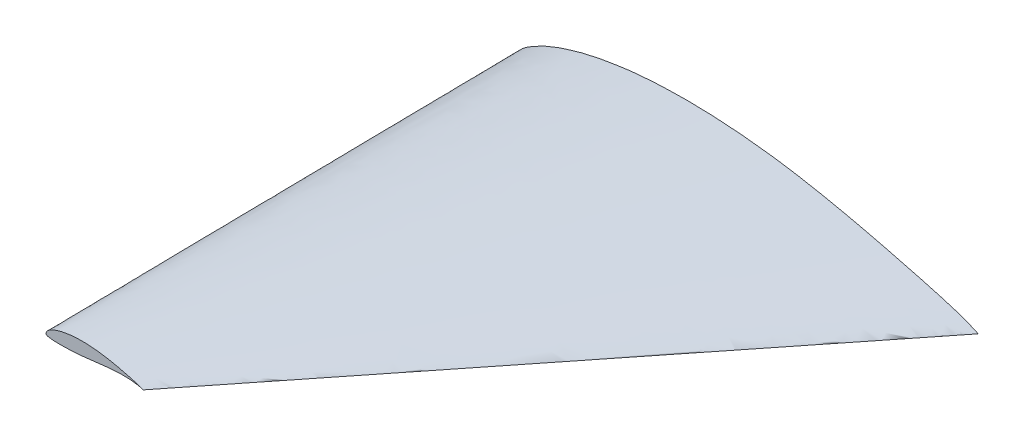
ISO-10303-21;
HEADER;
FILE_DESCRIPTION(('STEP AP214'),'2;1');
FILE_NAME('part.step','',(''),(''),'','','');
FILE_SCHEMA(('AUTOMOTIVE_DESIGN { 1 0 10303 214 1 1 1 1 }'));
ENDSEC;
DATA;
#1=APPLICATION_CONTEXT('core data for automotive mechanical design processes');
#2=APPLICATION_PROTOCOL_DEFINITION('international standard','automotive_design',2000,#1);
#3=PRODUCT_CONTEXT('',#1,'mechanical');
#4=PRODUCT('Part','Part','',(#3));
#5=PRODUCT_RELATED_PRODUCT_CATEGORY('part','',(#4));
#6=PRODUCT_DEFINITION_FORMATION('','',#4);
#7=PRODUCT_DEFINITION_CONTEXT('part definition',#1,'design');
#8=PRODUCT_DEFINITION('design','',#6,#7);
#9=PRODUCT_DEFINITION_SHAPE('','',#8);
#10=(LENGTH_UNIT() NAMED_UNIT(*) SI_UNIT(.MILLI.,.METRE.));
#11=(NAMED_UNIT(*) PLANE_ANGLE_UNIT() SI_UNIT($,.RADIAN.));
#12=(NAMED_UNIT(*) SI_UNIT($,.STERADIAN.) SOLID_ANGLE_UNIT());
#13=UNCERTAINTY_MEASURE_WITH_UNIT(LENGTH_MEASURE(1.E-05),#10,'distance_accuracy_value','');
#14=(GEOMETRIC_REPRESENTATION_CONTEXT(3) GLOBAL_UNCERTAINTY_ASSIGNED_CONTEXT((#13)) GLOBAL_UNIT_ASSIGNED_CONTEXT((#10,
#11,#12)) REPRESENTATION_CONTEXT('',''));
#15=CARTESIAN_POINT('',(0.,0.,0.));
#16=DIRECTION('',(0.,0.,1.));
#17=DIRECTION('',(1.,0.,0.));
#18=AXIS2_PLACEMENT_3D('',#15,#16,#17);
#19=CARTESIAN_POINT('',(3.63566016430738,12.8731300769274,0.));
#20=DIRECTION('',(0.,0.,-1.));
#21=DIRECTION('',(-1.,0.,0.));
#22=AXIS2_PLACEMENT_3D('',#19,#20,#21);
#23=PLANE('',#22);
#24=CARTESIAN_POINT('',(609.6,0.,0.));
#25=CARTESIAN_POINT('',(609.640250220161,0.0280382021375049,0.));
#26=CARTESIAN_POINT('',(608.273600949924,0.991597906494797,0.));
#27=CARTESIAN_POINT('',(606.750645735669,1.57760728388307,0.));
#28=CARTESIAN_POINT('',(603.273917166233,3.33402278008084,0.));
#29=CARTESIAN_POINT('',(598.853535085318,5.14379101560847,0.));
#30=CARTESIAN_POINT('',(593.037906504377,7.43654288929596,0.));
#31=CARTESIAN_POINT('',(586.036935584042,9.92047696154409,0.));
#32=CARTESIAN_POINT('',(577.80107358829,12.5986969431511,0.));
#33=CARTESIAN_POINT('',(568.409770871112,15.4715484257038,0.));
#34=CARTESIAN_POINT('',(557.881673990866,18.5085031455133,0.));
#35=CARTESIAN_POINT('',(546.287361494775,21.7798148146497,0.));
#36=CARTESIAN_POINT('',(533.635643822143,25.159398656286,0.));
#37=CARTESIAN_POINT('',(520.039582360879,28.8341493252529,0.));
#38=CARTESIAN_POINT('',(505.48232625381,32.5117139187355,0.));
#39=CARTESIAN_POINT('',(490.111119878469,36.4546792736563,0.));
#40=CARTESIAN_POINT('',(473.893166546495,40.2989331639401,0.));
#41=CARTESIAN_POINT('',(457.016136687147,44.4518304478845,0.));
#42=CARTESIAN_POINT('',(439.415459466033,48.3382333608458,0.));
#43=CARTESIAN_POINT('',(421.324380603662,52.5025118185633,0.));
#44=CARTESIAN_POINT('',(402.64165559914,56.1138719195973,0.));
#45=CARTESIAN_POINT('',(383.628725491852,59.9092582810321,0.));
#46=CARTESIAN_POINT('',(364.191152104201,62.9812414735311,0.));
#47=CARTESIAN_POINT('',(344.575118146023,66.1328189803733,0.));
#48=CARTESIAN_POINT('',(324.713786740934,68.3905465007161,0.));
#49=CARTESIAN_POINT('',(304.83428929943,70.7402948303201,0.));
#50=CARTESIAN_POINT('',(284.899979459847,72.112418245281,0.));
#51=CARTESIAN_POINT('',(265.09146364537,73.5900982867446,0.));
#52=CARTESIAN_POINT('',(245.422303484353,73.9498727804135,0.));
#53=CARTESIAN_POINT('',(226.022430014535,74.514069534288,0.));
#54=CARTESIAN_POINT('',(206.964729509532,73.8951557234952,0.));
#55=CARTESIAN_POINT('',(188.297777099902,73.5306858011844,0.));
#56=CARTESIAN_POINT('',(170.181116665737,71.8512527908715,0.));
#57=CARTESIAN_POINT('',(152.553772661755,70.5049054365717,0.));
#58=CARTESIAN_POINT('',(135.70395253647,67.7632680848869,0.));
#59=CARTESIAN_POINT('',(119.413950571098,65.5428836044923,0.));
#60=CARTESIAN_POINT('',(104.12397862409,61.9451449783644,0.));
#61=CARTESIAN_POINT('',(89.4335140290648,58.9828846616747,0.));
#62=CARTESIAN_POINT('',(75.9752067001072,54.6307865263074,0.));
#63=CARTESIAN_POINT('',(63.1215465717263,51.0399241973245,0.));
#64=CARTESIAN_POINT('',(51.7509151870812,46.0911000893142,0.));
#65=CARTESIAN_POINT('',(40.9203849347088,42.0631121435961,0.));
#66=CARTESIAN_POINT('',(31.8194259014922,36.7526777920157,0.));
#67=CARTESIAN_POINT('',(23.4327029045197,32.2641253838777,0.));
#68=CARTESIAN_POINT('',(16.2023977192562,27.6288591051838,0.));
#69=CARTESIAN_POINT('',(10.470797080345,22.3665949409993,0.));
#70=CARTESIAN_POINT('',(5.65948100997394,16.9298189199479,0.));
#71=CARTESIAN_POINT('',(2.65867308050129,11.0814468073618,0.));
#72=CARTESIAN_POINT('',(0.617865741920156,5.6065892205634,0.));
#73=CARTESIAN_POINT('',(-0.655929974111018,1.22218143363864,0.));
#74=CARTESIAN_POINT('',(0.77223615525635,-1.86037112445842,0.));
#75=CARTESIAN_POINT('',(2.97256895950321,-3.71820165809267,0.));
#76=CARTESIAN_POINT('',(5.83106954973854,-6.53548642981555,0.));
#77=CARTESIAN_POINT('',(10.8519938188363,-7.64180986963954,0.));
#78=CARTESIAN_POINT('',(16.4350524590104,-9.75767155241432,0.));
#79=CARTESIAN_POINT('',(23.6352250413085,-10.2554119591865,0.));
#80=CARTESIAN_POINT('',(31.7722077396816,-11.7719824313956,0.));
#81=CARTESIAN_POINT('',(41.2274276025361,-12.0422650376711,0.));
#82=CARTESIAN_POINT('',(51.7106543069825,-13.1390846087685,0.));
#83=CARTESIAN_POINT('',(63.3369523501553,-13.1929742213514,0.));
#84=CARTESIAN_POINT('',(75.9596642600287,-13.9195624984348,0.));
#85=CARTESIAN_POINT('',(89.5837164163294,-13.7084871910095,0.));
#86=CARTESIAN_POINT('',(104.121785794967,-14.0254315960758,0.));
#87=CARTESIAN_POINT('',(119.512839209373,-13.4556726948701,0.));
#88=CARTESIAN_POINT('',(135.71160985068,-13.2937387951918,0.));
#89=CARTESIAN_POINT('',(152.615912422796,-12.3377356179962,0.));
#90=CARTESIAN_POINT('',(170.198158768286,-11.6563148849318,0.));
#91=CARTESIAN_POINT('',(188.325886746462,-10.2462169966716,0.));
#92=CARTESIAN_POINT('',(206.983555568434,-8.98768281534167,0.));
#93=CARTESIAN_POINT('',(226.026826279837,-7.09343021965525,0.));
#94=CARTESIAN_POINT('',(245.435325997731,-5.21917612280218,0.));
#95=CARTESIAN_POINT('',(265.0767900219,-2.95754402091661,0.));
#96=CARTESIAN_POINT('',(284.905542794965,-0.663932666110339,0.));
#97=CARTESIAN_POINT('',(304.798464384908,1.88224392177554,0.));
#98=CARTESIAN_POINT('',(324.702196825654,4.36409938173803,0.));
#99=CARTESIAN_POINT('',(344.515603781599,6.81494828850699,0.));
#100=CARTESIAN_POINT('',(364.174266921564,8.98396056935296,0.));
#101=CARTESIAN_POINT('',(383.56045221599,11.1080408242607,0.));
#102=CARTESIAN_POINT('',(402.628011225793,12.789417349215,0.));
#103=CARTESIAN_POINT('',(421.260726998088,14.357438305201,0.));
#104=CARTESIAN_POINT('',(439.409781859954,15.4397859373893,0.));
#105=CARTESIAN_POINT('',(456.975503320671,16.3238460388803,0.));
#106=CARTESIAN_POINT('',(473.89420043377,16.7736670592904,0.));
#107=CARTESIAN_POINT('',(490.086340662839,16.9422671889964,0.));
#108=CARTESIAN_POINT('',(505.485612504189,16.7062051078885,0.));
#109=CARTESIAN_POINT('',(520.027650906029,16.1203246618677,0.));
#110=CARTESIAN_POINT('',(533.64708539769,15.1913621731538,0.));
#111=CARTESIAN_POINT('',(546.286886358491,14.017491788534,0.));
#112=CARTESIAN_POINT('',(557.889038006661,12.6028393785622,0.));
#113=CARTESIAN_POINT('',(568.412716917884,11.0466662696429,0.));
#114=CARTESIAN_POINT('',(577.807329036876,9.3581914256114,0.));
#115=CARTESIAN_POINT('',(586.034743447636,7.56237404335013,0.));
#116=CARTESIAN_POINT('',(593.043890905907,5.78303976681588,0.));
#117=CARTESIAN_POINT('',(598.85291485641,3.98242152843298,0.));
#118=CARTESIAN_POINT('',(603.260971943385,2.48665547089167,0.));
#119=CARTESIAN_POINT('',(606.741706407466,1.11972900764847,0.));
#120=CARTESIAN_POINT('',(608.239032163801,0.555969058067613,0.));
#121=CARTESIAN_POINT('',(609.565892996758,-0.0237588526817532,0.));
#122=CARTESIAN_POINT('',(609.6,0.,0.));
#123=B_SPLINE_CURVE_WITH_KNOTS('',3,(#24,#25,#26,#27,#28,#29,#30,#31,#32,#33,#34,#35,#36,#37,
#38,#39,#40,#41,#42,#43,#44,#45,#46,#47,#48,#49,#50,#51,#52,#53,#54,#55,#56,#57,#58,#59,#60,#61,
#62,#63,#64,#65,#66,#67,#68,#69,#70,#71,#72,#73,#74,#75,#76,#77,#78,#79,#80,#81,#82,#83,#84,#85,
#86,#87,#88,#89,#90,#91,#92,#93,#94,#95,#96,#97,#98,#99,#100,#101,#102,#103,#104,#105,#106,#107,
#108,#109,#110,#111,#112,#113,#114,#115,#116,#117,#118,#119,#120,#121,#122),.UNSPECIFIED.,.T.,
.F.,(4,1,1,1,1,1,1,1,1,1,1,1,1,1,1,1,1,1,1,1,1,1,1,1,1,1,1,1,1,1,1,1,1,1,1,1,1,1,1,1,1,1,1,1,1,
1,1,1,1,1,1,1,1,1,1,1,1,1,1,1,1,1,1,1,1,1,1,1,1,1,1,1,1,1,1,1,1,1,1,1,1,1,1,1,1,1,1,1,1,1,1,1,1,
1,1,1,4),(0.,0.000652375800474001,0.00240344824305293,0.00525656825777616,0.00916576414525399,
0.0140967507887129,0.0200220121070894,0.0268963436763612,0.0347063828713069,0.0434144575923079,
0.0529900197240517,0.0633968094728075,0.0746012542197577,0.0865310302989372,0.099154299734113,
0.112392946202992,0.126224491561968,0.140544888717164,0.155318673337255,0.170431652347923,
0.185859272314617,0.201486855100767,0.21729337680491,0.233167489320596,0.249086100090761,
0.264958726174628,0.280747986632832,0.296380919150158,0.311801213814499,0.326956198280747,
0.34178274714053,0.356247564285208,0.370274835051458,0.383861908178782,0.396887692238994,
0.409401211668324,0.421252505987224,0.432540778472774,0.44306525269204,0.452987148289923,
0.462044499089512,0.470525623352609,0.478015713742355,0.484719935647003,0.490901449374763,
0.496493482376747,0.501934630302492,0.506331603851298,0.510717666514293,0.511954044649899,
0.514195842006017,0.517506907461632,0.521314719070869,0.526107089755545,0.531740962786565,
0.538337761174815,0.545822104103918,0.554208083816506,0.563431264261174,0.573484426850772,
0.584310043394845,0.595866543172384,0.608108296907278,0.620979221659939,0.634441733895477,
0.648424207084819,0.662880137047378,0.677739163464503,0.692957281121996,0.708452452705004,
0.724176515371476,0.740041983978664,0.755990469053507,0.771938352799948,0.787811293886201,
0.803535896442132,0.819040498411977,0.834255057735326,0.849121194519524,0.863570137224621,
0.877552378440428,0.891006015922545,0.903874254768139,0.916114355519662,0.927680383940068,
0.938530909249465,0.948621564264013,0.957908586509766,0.96636362872513,0.97395265018994,
0.980639894713798,0.986402982837544,0.991206560358905,0.995011197109476,0.997773025834374,
0.999447193494769,1.),.UNSPECIFIED.);
#124=CARTESIAN_POINT('',(609.6,0.,0.));
#125=VERTEX_POINT('',#124);
#126=EDGE_CURVE('E11',#125,#125,#123,.T.);
#127=ORIENTED_EDGE('',*,*,#126,.F.);
#128=EDGE_LOOP('',(#127));
#129=FACE_BOUND('',#128,.T.);
#130=ADVANCED_FACE('F53',(#129),#23,.T.);
#131=CARTESIAN_POINT('',(0.757429200897371,2.68190209935988,609.6));
#132=DIRECTION('',(0.,0.,-1.));
#133=DIRECTION('',(-1.,0.,0.));
#134=AXIS2_PLACEMENT_3D('',#131,#132,#133);
#135=PLANE('',#134);
#136=CARTESIAN_POINT('',(127.,0.,609.6));
#137=CARTESIAN_POINT('',(127.008385462533,0.00584129211198019,609.6));
#138=CARTESIAN_POINT('',(126.723666864568,0.206582897186416,609.6));
#139=CARTESIAN_POINT('',(126.406384528264,0.328668184142306,609.6));
#140=CARTESIAN_POINT('',(125.682066076299,0.694588079183509,609.6));
#141=CARTESIAN_POINT('',(124.761153142774,1.07162312825176,609.6));
#142=CARTESIAN_POINT('',(123.549563855079,1.54927976860333,609.6));
#143=CARTESIAN_POINT('',(122.091028246675,2.06676603365502,609.6));
#144=CARTESIAN_POINT('',(120.375223664227,2.62472852982314,609.6));
#145=CARTESIAN_POINT('',(118.418702264815,3.22323925535497,609.6));
#146=CARTESIAN_POINT('',(116.225348748097,3.85593815531526,609.6));
#147=CARTESIAN_POINT('',(113.809866978078,4.53746141971868,609.6));
#148=CARTESIAN_POINT('',(111.174092462946,5.24154138672625,609.6));
#149=CARTESIAN_POINT('',(108.341579658516,6.00711444276102,609.6));
#150=CARTESIAN_POINT('',(105.308817969544,6.7732737330699,609.6));
#151=CARTESIAN_POINT('',(102.106483308014,7.59472484867839,609.6));
#152=CARTESIAN_POINT('',(98.7277430305198,8.39561107582085,609.6));
#153=CARTESIAN_POINT('',(95.2116951431557,9.26079800997593,609.6));
#154=CARTESIAN_POINT('',(91.5448873887569,10.0704652835096,609.6));
#155=CARTESIAN_POINT('',(87.7759126257628,10.938023295534,609.6));
#156=CARTESIAN_POINT('',(83.8836782498208,11.6903899832494,609.6));
#157=CARTESIAN_POINT('',(79.9226511441358,12.481095475215,609.6));
#158=CARTESIAN_POINT('',(75.8731566883751,13.1210919736523,609.6));
#159=CARTESIAN_POINT('',(71.7864829470882,13.7776706209111,609.6));
#160=CARTESIAN_POINT('',(67.6487055710278,14.2480305209825,609.6));
#161=CARTESIAN_POINT('',(63.507143604048,14.7375614229834,609.6));
#162=CARTESIAN_POINT('',(59.3541623874681,15.0234204677669,609.6));
#163=CARTESIAN_POINT('',(55.227388259452,15.3312704764051,609.6));
#164=CARTESIAN_POINT('',(51.1296465592403,15.4062234959195,609.6));
#165=CARTESIAN_POINT('',(47.0880062530282,15.52376448631,609.6));
#166=CARTESIAN_POINT('',(43.1176519811525,15.3948241090615,609.6));
#167=CARTESIAN_POINT('',(39.2287035624795,15.3188928752468,609.6));
#168=CARTESIAN_POINT('',(35.4543993053619,14.9690109980982,609.6));
#169=CARTESIAN_POINT('',(31.7820359711989,14.6885219659524,609.6));
#170=CARTESIAN_POINT('',(28.2716567784311,14.1173475176848,609.6));
#171=CARTESIAN_POINT('',(24.8779063689788,13.6547674176026,609.6));
#172=CARTESIAN_POINT('',(21.6924955466854,12.9052385371592,609.6));
#173=CARTESIAN_POINT('',(18.6319820893885,12.2881009711822,609.6));
#174=CARTESIAN_POINT('',(15.8281680625223,11.3814138596474,609.6));
#175=CARTESIAN_POINT('',(13.150322202443,10.6333175411093,609.6));
#176=CARTESIAN_POINT('',(10.7814406639753,9.60231251860712,609.6));
#177=CARTESIAN_POINT('',(8.525080194731,8.76314836324919,609.6));
#178=CARTESIAN_POINT('',(6.62904706281087,7.65680787333659,609.6));
#179=CARTESIAN_POINT('',(4.88181310510827,6.72169278830786,609.6));
#180=CARTESIAN_POINT('',(3.37549952484504,5.75601231357996,609.6));
#181=CARTESIAN_POINT('',(2.18141605840522,4.65970727937486,609.6));
#182=CARTESIAN_POINT('',(1.17905854374457,3.52704560832247,609.6));
#183=CARTESIAN_POINT('',(0.553890225104435,2.30863475153371,609.6));
#184=CARTESIAN_POINT('',(0.128722029566699,1.16803942095071,609.6));
#185=CARTESIAN_POINT('',(-0.136652077939795,0.25462113200805,609.6));
#186=CARTESIAN_POINT('',(0.160882532345073,-0.387577317595505,609.6));
#187=CARTESIAN_POINT('',(0.619285199896502,-0.774625345435973,609.6));
#188=CARTESIAN_POINT('',(1.21480615619553,-1.36155967287824,609.6));
#189=CARTESIAN_POINT('',(2.2608320455909,-1.59204372284157,609.6));
#190=CARTESIAN_POINT('',(3.42396926229384,-2.03284824008632,609.6));
#191=CARTESIAN_POINT('',(4.92400521693928,-2.13654415816385,609.6));
#192=CARTESIAN_POINT('',(6.619209945767,-2.45249633987409,609.6));
#193=CARTESIAN_POINT('',(8.58904741719502,-2.50880521618147,609.6));
#194=CARTESIAN_POINT('',(10.7730529806214,-2.73730929349345,609.6));
#195=CARTESIAN_POINT('',(13.1951984062824,-2.74853629611488,609.6));
#196=CARTESIAN_POINT('',(15.8249300541727,-2.89990885384057,609.6));
#197=CARTESIAN_POINT('',(18.6632742534019,-2.85593483146031,609.6));
#198=CARTESIAN_POINT('',(21.6920387072849,-2.92196491584912,609.6));
#199=CARTESIAN_POINT('',(24.8985081686195,-2.8032651447646,609.6));
#200=CARTESIAN_POINT('',(28.2732520522251,-2.76952891566496,609.6));
#201=CARTESIAN_POINT('',(31.7949817547491,-2.57036158708255,609.6));
#202=CARTESIAN_POINT('',(35.4579497433929,-2.42839893436079,609.6));
#203=CARTESIAN_POINT('',(39.2345597388463,-2.13462854097324,609.6));
#204=CARTESIAN_POINT('',(43.1215740767572,-1.87243391986285,609.6));
#205=CARTESIAN_POINT('',(47.0889221416327,-1.47779796242818,609.6));
#206=CARTESIAN_POINT('',(51.1323595828607,-1.08732835891712,609.6));
#207=CARTESIAN_POINT('',(55.2243312545625,-0.616155004357626,609.6));
#208=CARTESIAN_POINT('',(59.3553214156177,-0.138319305439654,609.6));
#209=CARTESIAN_POINT('',(63.4996800801891,0.392134150369905,609.6));
#210=CARTESIAN_POINT('',(67.6462910053447,0.909187371195423,609.6));
#211=CARTESIAN_POINT('',(71.7740841211665,1.41978089343896,609.6));
#212=CARTESIAN_POINT('',(75.8696389419926,1.87165845194853,609.6));
#213=CARTESIAN_POINT('',(79.9084275449979,2.31417517172098,609.6));
#214=CARTESIAN_POINT('',(83.8808356720401,2.66446194775313,609.6));
#215=CARTESIAN_POINT('',(87.762651457935,2.99113298025022,609.6));
#216=CARTESIAN_POINT('',(91.543704554157,3.21662207028945,609.6));
#217=CARTESIAN_POINT('',(95.2032298584732,3.40080125810007,609.6));
#218=CARTESIAN_POINT('',(98.7279584237021,3.49451397068551,609.6));
#219=CARTESIAN_POINT('',(102.101320971425,3.52963899770758,609.6));
#220=CARTESIAN_POINT('',(105.309502605039,3.48045939747677,609.6));
#221=CARTESIAN_POINT('',(108.339093938756,3.35840097122243,609.6));
#222=CARTESIAN_POINT('',(111.176476124519,3.16486711940705,609.6));
#223=CARTESIAN_POINT('',(113.809767991352,2.92031078927792,609.6));
#224=CARTESIAN_POINT('',(116.226882918054,2.62559153720047,609.6));
#225=CARTESIAN_POINT('',(118.419316024559,2.30138880617561,609.6));
#226=CARTESIAN_POINT('',(120.376526882683,1.94962321366904,609.6));
#227=CARTESIAN_POINT('',(122.090571551591,1.57549459236461,609.6));
#228=CARTESIAN_POINT('',(123.550810605397,1.20479995141997,609.6));
#229=CARTESIAN_POINT('',(124.761023928419,0.82967115175687,609.6));
#230=CARTESIAN_POINT('',(125.679369154872,0.518053223102432,609.6));
#231=CARTESIAN_POINT('',(126.404522168222,0.233276876593432,609.6));
#232=CARTESIAN_POINT('',(126.716465034125,0.115826887097419,609.6));
#233=CARTESIAN_POINT('',(126.992894374325,-0.00494976097536524,609.6));
#234=CARTESIAN_POINT('',(127.,0.,609.6));
#235=B_SPLINE_CURVE_WITH_KNOTS('',3,(#136,#137,#138,#139,#140,#141,#142,#143,#144,#145,#146,
#147,#148,#149,#150,#151,#152,#153,#154,#155,#156,#157,#158,#159,#160,#161,#162,#163,#164,#165,
#166,#167,#168,#169,#170,#171,#172,#173,#174,#175,#176,#177,#178,#179,#180,#181,#182,#183,#184,
#185,#186,#187,#188,#189,#190,#191,#192,#193,#194,#195,#196,#197,#198,#199,#200,#201,#202,#203,
#204,#205,#206,#207,#208,#209,#210,#211,#212,#213,#214,#215,#216,#217,#218,#219,#220,#221,#222,
#223,#224,#225,#226,#227,#228,#229,#230,#231,#232,#233,#234),.UNSPECIFIED.,.T.,.F.,(4,1,1,1,1,1,
1,1,1,1,1,1,1,1,1,1,1,1,1,1,1,1,1,1,1,1,1,1,1,1,1,1,1,1,1,1,1,1,1,1,1,1,1,1,1,1,1,1,1,1,1,1,1,1,
1,1,1,1,1,1,1,1,1,1,1,1,1,1,1,1,1,1,1,1,1,1,1,1,1,1,1,1,1,1,1,1,1,1,1,1,1,1,1,1,1,1,4),(0.,
0.000652375800474001,0.00240344824305293,0.00525656825777616,0.00916576414525399,
0.0140967507887129,0.0200220121070894,0.0268963436763612,0.0347063828713069,0.0434144575923079,
0.0529900197240517,0.0633968094728075,0.0746012542197577,0.0865310302989372,0.099154299734113,
0.112392946202992,0.126224491561968,0.140544888717164,0.155318673337255,0.170431652347923,
0.185859272314617,0.201486855100767,0.21729337680491,0.233167489320596,0.249086100090761,
0.264958726174628,0.280747986632832,0.296380919150158,0.311801213814499,0.326956198280747,
0.34178274714053,0.356247564285208,0.370274835051458,0.383861908178782,0.396887692238994,
0.409401211668324,0.421252505987224,0.432540778472774,0.44306525269204,0.452987148289923,
0.462044499089512,0.470525623352609,0.478015713742355,0.484719935647003,0.490901449374763,
0.496493482376747,0.501934630302492,0.506331603851298,0.510717666514293,0.511954044649899,
0.514195842006017,0.517506907461632,0.521314719070869,0.526107089755545,0.531740962786565,
0.538337761174815,0.545822104103918,0.554208083816506,0.563431264261174,0.573484426850772,
0.584310043394845,0.595866543172384,0.608108296907278,0.620979221659939,0.634441733895477,
0.648424207084819,0.662880137047378,0.677739163464503,0.692957281121996,0.708452452705004,
0.724176515371476,0.740041983978664,0.755990469053507,0.771938352799948,0.787811293886201,
0.803535896442132,0.819040498411977,0.834255057735326,0.849121194519524,0.863570137224621,
0.877552378440428,0.891006015922545,0.903874254768139,0.916114355519662,0.927680383940068,
0.938530909249465,0.948621564264013,0.957908586509766,0.96636362872513,0.97395265018994,
0.980639894713798,0.986402982837544,0.991206560358905,0.995011197109476,0.997773025834374,
0.999447193494769,1.),.UNSPECIFIED.);
#236=CARTESIAN_POINT('',(127.,0.,609.6));
#237=VERTEX_POINT('',#236);
#238=EDGE_CURVE('E64',#237,#237,#235,.T.);
#239=ORIENTED_EDGE('',*,*,#238,.T.);
#240=EDGE_LOOP('',(#239));
#241=FACE_BOUND('',#240,.T.);
#242=ADVANCED_FACE('F94',(#241),#135,.F.);
#243=CARTESIAN_POINT('',(127.,0.,609.6));
#244=CARTESIAN_POINT('',(609.6,0.,0.));
#245=CARTESIAN_POINT('',(126.992894374325,-0.00494976097536525,609.6));
#246=CARTESIAN_POINT('',(609.565892996758,-0.0237588526817532,0.));
#247=CARTESIAN_POINT('',(126.716465034125,0.115826887097419,609.6));
#248=CARTESIAN_POINT('',(608.239032163801,0.555969058067613,0.));
#249=CARTESIAN_POINT('',(126.404522168222,0.233276876593432,609.6));
#250=CARTESIAN_POINT('',(606.741706407466,1.11972900764847,0.));
#251=CARTESIAN_POINT('',(125.679369154872,0.518053223102432,609.6));
#252=CARTESIAN_POINT('',(603.260971943385,2.48665547089167,0.));
#253=CARTESIAN_POINT('',(124.761023928419,0.82967115175687,609.6));
#254=CARTESIAN_POINT('',(598.85291485641,3.98242152843298,0.));
#255=CARTESIAN_POINT('',(123.550810605397,1.20479995141997,609.6));
#256=CARTESIAN_POINT('',(593.043890905907,5.78303976681588,0.));
#257=CARTESIAN_POINT('',(122.090571551591,1.57549459236461,609.6));
#258=CARTESIAN_POINT('',(586.034743447636,7.56237404335013,0.));
#259=CARTESIAN_POINT('',(120.376526882683,1.94962321366904,609.6));
#260=CARTESIAN_POINT('',(577.807329036876,9.3581914256114,0.));
#261=CARTESIAN_POINT('',(118.419316024559,2.30138880617561,609.6));
#262=CARTESIAN_POINT('',(568.412716917884,11.0466662696429,0.));
#263=CARTESIAN_POINT('',(116.226882918054,2.62559153720047,609.6));
#264=CARTESIAN_POINT('',(557.889038006661,12.6028393785622,0.));
#265=CARTESIAN_POINT('',(113.809767991352,2.92031078927792,609.6));
#266=CARTESIAN_POINT('',(546.286886358491,14.017491788534,0.));
#267=CARTESIAN_POINT('',(111.176476124519,3.16486711940705,609.6));
#268=CARTESIAN_POINT('',(533.64708539769,15.1913621731538,0.));
#269=CARTESIAN_POINT('',(108.339093938756,3.35840097122243,609.6));
#270=CARTESIAN_POINT('',(520.027650906029,16.1203246618677,0.));
#271=CARTESIAN_POINT('',(105.309502605039,3.48045939747677,609.6));
#272=CARTESIAN_POINT('',(505.485612504189,16.7062051078885,0.));
#273=CARTESIAN_POINT('',(102.101320971425,3.52963899770758,609.6));
#274=CARTESIAN_POINT('',(490.086340662839,16.9422671889964,0.));
#275=CARTESIAN_POINT('',(98.7279584237021,3.49451397068551,609.6));
#276=CARTESIAN_POINT('',(473.89420043377,16.7736670592904,0.));
#277=CARTESIAN_POINT('',(95.2032298584732,3.40080125810007,609.6));
#278=CARTESIAN_POINT('',(456.975503320671,16.3238460388803,0.));
#279=CARTESIAN_POINT('',(91.543704554157,3.21662207028945,609.6));
#280=CARTESIAN_POINT('',(439.409781859954,15.4397859373893,0.));
#281=CARTESIAN_POINT('',(87.762651457935,2.99113298025022,609.6));
#282=CARTESIAN_POINT('',(421.260726998088,14.357438305201,0.));
#283=CARTESIAN_POINT('',(83.8808356720401,2.66446194775313,609.6));
#284=CARTESIAN_POINT('',(402.628011225793,12.789417349215,0.));
#285=CARTESIAN_POINT('',(79.9084275449979,2.31417517172098,609.6));
#286=CARTESIAN_POINT('',(383.56045221599,11.1080408242607,0.));
#287=CARTESIAN_POINT('',(75.8696389419926,1.87165845194853,609.6));
#288=CARTESIAN_POINT('',(364.174266921564,8.98396056935296,0.));
#289=CARTESIAN_POINT('',(71.7740841211665,1.41978089343896,609.6));
#290=CARTESIAN_POINT('',(344.515603781599,6.81494828850699,0.));
#291=CARTESIAN_POINT('',(67.6462910053447,0.909187371195423,609.6));
#292=CARTESIAN_POINT('',(324.702196825654,4.36409938173803,0.));
#293=CARTESIAN_POINT('',(63.4996800801891,0.392134150369905,609.6));
#294=CARTESIAN_POINT('',(304.798464384908,1.88224392177554,0.));
#295=CARTESIAN_POINT('',(59.3553214156177,-0.138319305439654,609.6));
#296=CARTESIAN_POINT('',(284.905542794965,-0.663932666110339,0.));
#297=CARTESIAN_POINT('',(55.2243312545625,-0.616155004357626,609.6));
#298=CARTESIAN_POINT('',(265.0767900219,-2.95754402091661,0.));
#299=CARTESIAN_POINT('',(51.1323595828607,-1.08732835891712,609.6));
#300=CARTESIAN_POINT('',(245.435325997731,-5.21917612280218,0.));
#301=CARTESIAN_POINT('',(47.0889221416327,-1.47779796242818,609.6));
#302=CARTESIAN_POINT('',(226.026826279837,-7.09343021965525,0.));
#303=CARTESIAN_POINT('',(43.1215740767572,-1.87243391986285,609.6));
#304=CARTESIAN_POINT('',(206.983555568434,-8.98768281534167,0.));
#305=CARTESIAN_POINT('',(39.2345597388463,-2.13462854097324,609.6));
#306=CARTESIAN_POINT('',(188.325886746462,-10.2462169966716,0.));
#307=CARTESIAN_POINT('',(35.4579497433929,-2.42839893436079,609.6));
#308=CARTESIAN_POINT('',(170.198158768286,-11.6563148849318,0.));
#309=CARTESIAN_POINT('',(31.7949817547491,-2.57036158708255,609.6));
#310=CARTESIAN_POINT('',(152.615912422796,-12.3377356179962,0.));
#311=CARTESIAN_POINT('',(28.2732520522251,-2.76952891566496,609.6));
#312=CARTESIAN_POINT('',(135.71160985068,-13.2937387951918,0.));
#313=CARTESIAN_POINT('',(24.8985081686195,-2.8032651447646,609.6));
#314=CARTESIAN_POINT('',(119.512839209373,-13.4556726948701,0.));
#315=CARTESIAN_POINT('',(21.6920387072849,-2.92196491584912,609.6));
#316=CARTESIAN_POINT('',(104.121785794967,-14.0254315960758,0.));
#317=CARTESIAN_POINT('',(18.6632742534019,-2.85593483146031,609.6));
#318=CARTESIAN_POINT('',(89.5837164163294,-13.7084871910095,0.));
#319=CARTESIAN_POINT('',(15.8249300541727,-2.89990885384057,609.6));
#320=CARTESIAN_POINT('',(75.9596642600287,-13.9195624984348,0.));
#321=CARTESIAN_POINT('',(13.1951984062824,-2.74853629611488,609.6));
#322=CARTESIAN_POINT('',(63.3369523501553,-13.1929742213514,0.));
#323=CARTESIAN_POINT('',(10.7730529806214,-2.73730929349345,609.6));
#324=CARTESIAN_POINT('',(51.7106543069825,-13.1390846087685,0.));
#325=CARTESIAN_POINT('',(8.58904741719502,-2.50880521618147,609.6));
#326=CARTESIAN_POINT('',(41.2274276025361,-12.0422650376711,0.));
#327=CARTESIAN_POINT('',(6.619209945767,-2.45249633987409,609.6));
#328=CARTESIAN_POINT('',(31.7722077396816,-11.7719824313956,0.));
#329=CARTESIAN_POINT('',(4.92400521693928,-2.13654415816385,609.6));
#330=CARTESIAN_POINT('',(23.6352250413085,-10.2554119591865,0.));
#331=CARTESIAN_POINT('',(3.42396926229384,-2.03284824008632,609.6));
#332=CARTESIAN_POINT('',(16.4350524590104,-9.75767155241432,0.));
#333=CARTESIAN_POINT('',(2.2608320455909,-1.59204372284157,609.6));
#334=CARTESIAN_POINT('',(10.8519938188363,-7.64180986963954,0.));
#335=CARTESIAN_POINT('',(1.21480615619553,-1.36155967287824,609.6));
#336=CARTESIAN_POINT('',(5.83106954973854,-6.53548642981555,0.));
#337=CARTESIAN_POINT('',(0.619285199896502,-0.774625345435973,609.6));
#338=CARTESIAN_POINT('',(2.97256895950321,-3.71820165809267,0.));
#339=CARTESIAN_POINT('',(0.160882532345073,-0.387577317595505,609.6));
#340=CARTESIAN_POINT('',(0.77223615525635,-1.86037112445842,0.));
#341=CARTESIAN_POINT('',(-0.136652077939795,0.25462113200805,609.6));
#342=CARTESIAN_POINT('',(-0.655929974111018,1.22218143363864,0.));
#343=CARTESIAN_POINT('',(0.128722029566699,1.16803942095071,609.6));
#344=CARTESIAN_POINT('',(0.617865741920156,5.6065892205634,0.));
#345=CARTESIAN_POINT('',(0.553890225104435,2.30863475153371,609.6));
#346=CARTESIAN_POINT('',(2.65867308050129,11.0814468073618,0.));
#347=CARTESIAN_POINT('',(1.17905854374457,3.52704560832247,609.6));
#348=CARTESIAN_POINT('',(5.65948100997394,16.9298189199479,0.));
#349=CARTESIAN_POINT('',(2.18141605840522,4.65970727937486,609.6));
#350=CARTESIAN_POINT('',(10.470797080345,22.3665949409993,0.));
#351=CARTESIAN_POINT('',(3.37549952484504,5.75601231357996,609.6));
#352=CARTESIAN_POINT('',(16.2023977192562,27.6288591051838,0.));
#353=CARTESIAN_POINT('',(4.88181310510827,6.72169278830786,609.6));
#354=CARTESIAN_POINT('',(23.4327029045197,32.2641253838777,0.));
#355=CARTESIAN_POINT('',(6.62904706281087,7.65680787333659,609.6));
#356=CARTESIAN_POINT('',(31.8194259014922,36.7526777920157,0.));
#357=CARTESIAN_POINT('',(8.525080194731,8.76314836324919,609.6));
#358=CARTESIAN_POINT('',(40.9203849347088,42.0631121435961,0.));
#359=CARTESIAN_POINT('',(10.7814406639753,9.60231251860712,609.6));
#360=CARTESIAN_POINT('',(51.7509151870812,46.0911000893142,0.));
#361=CARTESIAN_POINT('',(13.150322202443,10.6333175411093,609.6));
#362=CARTESIAN_POINT('',(63.1215465717263,51.0399241973245,0.));
#363=CARTESIAN_POINT('',(15.8281680625223,11.3814138596474,609.6));
#364=CARTESIAN_POINT('',(75.9752067001072,54.6307865263074,0.));
#365=CARTESIAN_POINT('',(18.6319820893885,12.2881009711822,609.6));
#366=CARTESIAN_POINT('',(89.4335140290648,58.9828846616747,0.));
#367=CARTESIAN_POINT('',(21.6924955466854,12.9052385371592,609.6));
#368=CARTESIAN_POINT('',(104.12397862409,61.9451449783644,0.));
#369=CARTESIAN_POINT('',(24.8779063689788,13.6547674176026,609.6));
#370=CARTESIAN_POINT('',(119.413950571098,65.5428836044923,0.));
#371=CARTESIAN_POINT('',(28.2716567784311,14.1173475176848,609.6));
#372=CARTESIAN_POINT('',(135.70395253647,67.7632680848869,0.));
#373=CARTESIAN_POINT('',(31.7820359711989,14.6885219659524,609.6));
#374=CARTESIAN_POINT('',(152.553772661755,70.5049054365717,0.));
#375=CARTESIAN_POINT('',(35.4543993053619,14.9690109980982,609.6));
#376=CARTESIAN_POINT('',(170.181116665737,71.8512527908715,0.));
#377=CARTESIAN_POINT('',(39.2287035624795,15.3188928752468,609.6));
#378=CARTESIAN_POINT('',(188.297777099902,73.5306858011844,0.));
#379=CARTESIAN_POINT('',(43.1176519811525,15.3948241090615,609.6));
#380=CARTESIAN_POINT('',(206.964729509532,73.8951557234952,0.));
#381=CARTESIAN_POINT('',(47.0880062530282,15.52376448631,609.6));
#382=CARTESIAN_POINT('',(226.022430014535,74.514069534288,0.));
#383=CARTESIAN_POINT('',(51.1296465592403,15.4062234959195,609.6));
#384=CARTESIAN_POINT('',(245.422303484353,73.9498727804135,0.));
#385=CARTESIAN_POINT('',(55.227388259452,15.3312704764051,609.6));
#386=CARTESIAN_POINT('',(265.09146364537,73.5900982867446,0.));
#387=CARTESIAN_POINT('',(59.3541623874681,15.0234204677669,609.6));
#388=CARTESIAN_POINT('',(284.899979459847,72.112418245281,0.));
#389=CARTESIAN_POINT('',(63.507143604048,14.7375614229834,609.6));
#390=CARTESIAN_POINT('',(304.83428929943,70.7402948303201,0.));
#391=CARTESIAN_POINT('',(67.6487055710278,14.2480305209825,609.6));
#392=CARTESIAN_POINT('',(324.713786740934,68.3905465007161,0.));
#393=CARTESIAN_POINT('',(71.7864829470882,13.7776706209111,609.6));
#394=CARTESIAN_POINT('',(344.575118146023,66.1328189803733,0.));
#395=CARTESIAN_POINT('',(75.8731566883751,13.1210919736523,609.6));
#396=CARTESIAN_POINT('',(364.191152104201,62.9812414735311,0.));
#397=CARTESIAN_POINT('',(79.9226511441358,12.481095475215,609.6));
#398=CARTESIAN_POINT('',(383.628725491852,59.9092582810321,0.));
#399=CARTESIAN_POINT('',(83.8836782498208,11.6903899832494,609.6));
#400=CARTESIAN_POINT('',(402.64165559914,56.1138719195973,0.));
#401=CARTESIAN_POINT('',(87.7759126257628,10.938023295534,609.6));
#402=CARTESIAN_POINT('',(421.324380603662,52.5025118185633,0.));
#403=CARTESIAN_POINT('',(91.5448873887569,10.0704652835096,609.6));
#404=CARTESIAN_POINT('',(439.415459466033,48.3382333608458,0.));
#405=CARTESIAN_POINT('',(95.2116951431557,9.26079800997593,609.6));
#406=CARTESIAN_POINT('',(457.016136687147,44.4518304478845,0.));
#407=CARTESIAN_POINT('',(98.7277430305198,8.39561107582085,609.6));
#408=CARTESIAN_POINT('',(473.893166546495,40.2989331639401,0.));
#409=CARTESIAN_POINT('',(102.106483308014,7.59472484867839,609.6));
#410=CARTESIAN_POINT('',(490.111119878469,36.4546792736563,0.));
#411=CARTESIAN_POINT('',(105.308817969544,6.7732737330699,609.6));
#412=CARTESIAN_POINT('',(505.48232625381,32.5117139187355,0.));
#413=CARTESIAN_POINT('',(108.341579658516,6.00711444276102,609.6));
#414=CARTESIAN_POINT('',(520.039582360879,28.8341493252529,0.));
#415=CARTESIAN_POINT('',(111.174092462946,5.24154138672625,609.6));
#416=CARTESIAN_POINT('',(533.635643822143,25.159398656286,0.));
#417=CARTESIAN_POINT('',(113.809866978078,4.53746141971868,609.6));
#418=CARTESIAN_POINT('',(546.287361494775,21.7798148146497,0.));
#419=CARTESIAN_POINT('',(116.225348748097,3.85593815531526,609.6));
#420=CARTESIAN_POINT('',(557.881673990866,18.5085031455133,0.));
#421=CARTESIAN_POINT('',(118.418702264815,3.22323925535497,609.6));
#422=CARTESIAN_POINT('',(568.409770871112,15.4715484257038,0.));
#423=CARTESIAN_POINT('',(120.375223664227,2.62472852982314,609.6));
#424=CARTESIAN_POINT('',(577.80107358829,12.5986969431511,0.));
#425=CARTESIAN_POINT('',(122.091028246675,2.06676603365502,609.6));
#426=CARTESIAN_POINT('',(586.036935584042,9.92047696154409,0.));
#427=CARTESIAN_POINT('',(123.549563855079,1.54927976860333,609.6));
#428=CARTESIAN_POINT('',(593.037906504377,7.43654288929596,0.));
#429=CARTESIAN_POINT('',(124.761153142774,1.07162312825176,609.6));
#430=CARTESIAN_POINT('',(598.853535085318,5.14379101560847,0.));
#431=CARTESIAN_POINT('',(125.682066076299,0.694588079183509,609.6));
#432=CARTESIAN_POINT('',(603.273917166233,3.33402278008084,0.));
#433=CARTESIAN_POINT('',(126.406384528264,0.328668184142306,609.6));
#434=CARTESIAN_POINT('',(606.750645735669,1.57760728388307,0.));
#435=CARTESIAN_POINT('',(126.723666864568,0.206582897186416,609.6));
#436=CARTESIAN_POINT('',(608.273600949924,0.991597906494797,0.));
#437=CARTESIAN_POINT('',(127.008385462533,0.00584129211197252,609.6));
#438=CARTESIAN_POINT('',(609.640250220161,0.028038202137468,0.));
#439=CARTESIAN_POINT('',(127.,0.,609.6));
#440=CARTESIAN_POINT('',(609.6,0.,0.));
#441=B_SPLINE_SURFACE_WITH_KNOTS('',3,1,((#243,#244),(#245,#246),(#247,#248),(#249,#250),(#251,
#252),(#253,#254),(#255,#256),(#257,#258),(#259,#260),(#261,#262),(#263,#264),(#265,#266),(#267,
#268),(#269,#270),(#271,#272),(#273,#274),(#275,#276),(#277,#278),(#279,#280),(#281,#282),(#283,
#284),(#285,#286),(#287,#288),(#289,#290),(#291,#292),(#293,#294),(#295,#296),(#297,#298),(#299,
#300),(#301,#302),(#303,#304),(#305,#306),(#307,#308),(#309,#310),(#311,#312),(#313,#314),(#315,
#316),(#317,#318),(#319,#320),(#321,#322),(#323,#324),(#325,#326),(#327,#328),(#329,#330),(#331,
#332),(#333,#334),(#335,#336),(#337,#338),(#339,#340),(#341,#342),(#343,#344),(#345,#346),(#347,
#348),(#349,#350),(#351,#352),(#353,#354),(#355,#356),(#357,#358),(#359,#360),(#361,#362),(#363,
#364),(#365,#366),(#367,#368),(#369,#370),(#371,#372),(#373,#374),(#375,#376),(#377,#378),(#379,
#380),(#381,#382),(#383,#384),(#385,#386),(#387,#388),(#389,#390),(#391,#392),(#393,#394),(#395,
#396),(#397,#398),(#399,#400),(#401,#402),(#403,#404),(#405,#406),(#407,#408),(#409,#410),(#411,
#412),(#413,#414),(#415,#416),(#417,#418),(#419,#420),(#421,#422),(#423,#424),(#425,#426),(#427,
#428),(#429,#430),(#431,#432),(#433,#434),(#435,#436),(#437,#438),(#439,#440)),.UNSPECIFIED.,
.T.,.F.,.F.,(4,1,1,1,1,1,1,1,1,1,1,1,1,1,1,1,1,1,1,1,1,1,1,1,1,1,1,1,1,1,1,1,1,1,1,1,1,1,1,1,1,
1,1,1,1,1,1,1,1,1,1,1,1,1,1,1,1,1,1,1,1,1,1,1,1,1,1,1,1,1,1,1,1,1,1,1,1,1,1,1,1,1,1,1,1,1,1,1,1,
1,1,1,1,1,1,1,4),(2,2),(0.,0.00055280650523104,0.00222697416562589,0.00498880289052417,
0.00879343964109525,0.013597017162456,0.0193601052862016,0.0260473498100597,0.0336363712748698,
0.042091413490234,0.0513784357359873,0.0614690907505354,0.0723196160599322,0.083885644480338,
0.0961257452318606,0.108993984077455,0.122447621559572,0.136429862775379,0.150878805480476,
0.165744942264674,0.180959501588023,0.196464103557868,0.212188706113799,0.228061647200052,
0.244009530946493,0.259958016021336,0.275823484628524,0.291547547294996,0.307042718878004,
0.322260836535497,0.337119862952622,0.351575792915181,0.365558266104523,0.379020778340061,
0.391891703092722,0.404133456827616,0.415689956605155,0.426515573149228,0.436568735738826,
0.445791916183494,0.454177895896082,0.461662238825185,0.468259037213435,0.473892910244455,
0.478685280929131,0.482493092538368,0.485804157993983,0.488045955350101,0.489282333485707,
0.493668396148702,0.498065369697508,0.503506517623253,0.509098550625237,0.515280064352996,
0.521984286257645,0.529474376647391,0.537955500910488,0.547012851710077,0.55693474730796,
0.567459221527226,0.578747494012776,0.590598788331676,0.603112307761006,0.616138091821218,
0.629725164948542,0.643752435714792,0.65821725285947,0.673043801719253,0.688198786185501,
0.703619080849842,0.719252013367168,0.735041273825372,0.750913899909239,0.766832510679404,
0.78270662319509,0.798513144899233,0.814140727685383,0.829568347652077,0.844681326662745,
0.859455111282836,0.873775508438032,0.887607053797008,0.900845700265887,0.913468969701063,
0.925398745780242,0.936603190527193,0.947009980275948,0.956585542407692,0.965293617128693,
0.973103656323639,0.979977987892911,0.985903249211287,0.990834235854746,0.994743431742224,
0.997596551756947,0.999347624199526,1.),(0.,1.),.UNSPECIFIED.);
#442=ORIENTED_EDGE('',*,*,#238,.F.);
#443=EDGE_LOOP('',(#442));
#444=FACE_BOUND('',#443,.T.);
#445=ORIENTED_EDGE('',*,*,#126,.T.);
#446=EDGE_LOOP('',(#445));
#447=FACE_BOUND('',#446,.T.);
#448=ADVANCED_FACE('F102',(#444,#447),#441,.T.);
#449=CLOSED_SHELL('',(#130,#242,#448));
#450=MANIFOLD_SOLID_BREP('B2',#449);
#451=ADVANCED_BREP_SHAPE_REPRESENTATION('',(#18,#450),#14);
#452=SHAPE_DEFINITION_REPRESENTATION(#9,#451);
ENDSEC;
END-ISO-10303-21;
